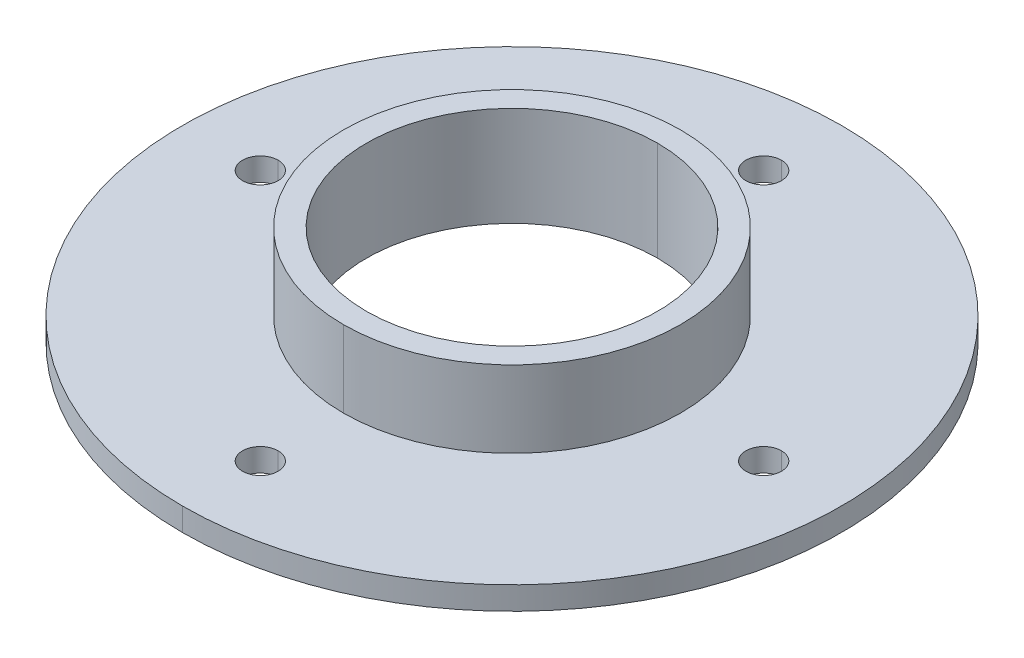
ISO-10303-21;
HEADER;
FILE_DESCRIPTION(('STEP AP214'),'2;1');
FILE_NAME('part.step','',(''),(''),'','','');
FILE_SCHEMA(('AUTOMOTIVE_DESIGN { 1 0 10303 214 1 1 1 1 }'));
ENDSEC;
DATA;
#1=APPLICATION_CONTEXT('core data for automotive mechanical design processes');
#2=APPLICATION_PROTOCOL_DEFINITION('international standard','automotive_design',2000,#1);
#3=PRODUCT_CONTEXT('',#1,'mechanical');
#4=PRODUCT('Part','Part','',(#3));
#5=PRODUCT_RELATED_PRODUCT_CATEGORY('part','',(#4));
#6=PRODUCT_DEFINITION_FORMATION('','',#4);
#7=PRODUCT_DEFINITION_CONTEXT('part definition',#1,'design');
#8=PRODUCT_DEFINITION('design','',#6,#7);
#9=PRODUCT_DEFINITION_SHAPE('','',#8);
#10=(LENGTH_UNIT() NAMED_UNIT(*) SI_UNIT(.MILLI.,.METRE.));
#11=(NAMED_UNIT(*) PLANE_ANGLE_UNIT() SI_UNIT($,.RADIAN.));
#12=(NAMED_UNIT(*) SI_UNIT($,.STERADIAN.) SOLID_ANGLE_UNIT());
#13=UNCERTAINTY_MEASURE_WITH_UNIT(LENGTH_MEASURE(1.E-05),#10,'distance_accuracy_value','');
#14=(GEOMETRIC_REPRESENTATION_CONTEXT(3) GLOBAL_UNCERTAINTY_ASSIGNED_CONTEXT((#13)) GLOBAL_UNIT_ASSIGNED_CONTEXT((#10,
#11,#12)) REPRESENTATION_CONTEXT('',''));
#15=CARTESIAN_POINT('',(0.,0.,0.));
#16=DIRECTION('',(0.,0.,1.));
#17=DIRECTION('',(1.,0.,0.));
#18=AXIS2_PLACEMENT_3D('',#15,#16,#17);
#19=CARTESIAN_POINT('',(0.,-17.,-32.8376892049422));
#20=DIRECTION('',(0.,1.,0.));
#21=DIRECTION('',(0.,0.,1.));
#22=AXIS2_PLACEMENT_3D('',#19,#20,#21);
#23=CYLINDRICAL_SURFACE('',#22,2.32018909355612);
#24=DIRECTION('',(0.,1.,0.));
#25=VECTOR('',#24,1.);
#26=CARTESIAN_POINT('',(0.,-17.,-35.1578782984983));
#27=LINE('',#26,#25);
#28=CARTESIAN_POINT('',(0.,0.,-35.1578782984983));
#29=VERTEX_POINT('',#28);
#30=CARTESIAN_POINT('',(0.,3.,-35.1578782984983));
#31=VERTEX_POINT('',#30);
#32=EDGE_CURVE('E256',#29,#31,#27,.T.);
#33=ORIENTED_EDGE('',*,*,#32,.F.);
#34=CARTESIAN_POINT('',(0.,0.,-32.8376892049422));
#35=DIRECTION('',(0.,1.,0.));
#36=DIRECTION('',(0.,0.,1.));
#37=AXIS2_PLACEMENT_3D('',#34,#35,#36);
#38=CIRCLE('',#37,2.32018909355612);
#39=CARTESIAN_POINT('',(0.,0.,-30.5175001113861));
#40=VERTEX_POINT('',#39);
#41=EDGE_CURVE('E82',#40,#29,#38,.T.);
#42=ORIENTED_EDGE('',*,*,#41,.F.);
#43=DIRECTION('',(0.,1.,0.));
#44=VECTOR('',#43,1.);
#45=CARTESIAN_POINT('',(0.,-17.,-30.5175001113861));
#46=LINE('',#45,#44);
#47=CARTESIAN_POINT('',(0.,3.,-30.5175001113861));
#48=VERTEX_POINT('',#47);
#49=EDGE_CURVE('E192',#40,#48,#46,.T.);
#50=ORIENTED_EDGE('',*,*,#49,.T.);
#51=CARTESIAN_POINT('',(0.,3.,-32.8376892049422));
#52=DIRECTION('',(0.,1.,0.));
#53=DIRECTION('',(0.,0.,1.));
#54=AXIS2_PLACEMENT_3D('',#51,#52,#53);
#55=CIRCLE('',#54,2.32018909355612);
#56=EDGE_CURVE('E69',#48,#31,#55,.T.);
#57=ORIENTED_EDGE('',*,*,#56,.T.);
#58=EDGE_LOOP('',(#33,#42,#50,#57));
#59=FACE_BOUND('',#58,.T.);
#60=ADVANCED_FACE('F15',(#59),#23,.F.);
#61=CARTESIAN_POINT('',(32.8376892049432,-17.,-9.27271075302349E-13));
#62=DIRECTION('',(0.,1.,0.));
#63=DIRECTION('',(0.,0.,1.));
#64=AXIS2_PLACEMENT_3D('',#61,#62,#63);
#65=CYLINDRICAL_SURFACE('',#64,2.32018909355684);
#66=DIRECTION('',(0.,1.,0.));
#67=VECTOR('',#66,1.);
#68=CARTESIAN_POINT('',(32.8376892049432,-17.,-2.32018909355777));
#69=LINE('',#68,#67);
#70=CARTESIAN_POINT('',(32.8376892049432,0.,-2.32018909355777));
#71=VERTEX_POINT('',#70);
#72=CARTESIAN_POINT('',(32.8376892049432,3.,-2.32018909355777));
#73=VERTEX_POINT('',#72);
#74=EDGE_CURVE('E174',#71,#73,#69,.T.);
#75=ORIENTED_EDGE('',*,*,#74,.F.);
#76=CARTESIAN_POINT('',(32.8376892049432,0.,-9.27271075302349E-13));
#77=DIRECTION('',(0.,1.,0.));
#78=DIRECTION('',(0.,0.,1.));
#79=AXIS2_PLACEMENT_3D('',#76,#77,#78);
#80=CIRCLE('',#79,2.32018909355684);
#81=CARTESIAN_POINT('',(32.8376892049432,0.,2.32018909355592));
#82=VERTEX_POINT('',#81);
#83=EDGE_CURVE('E168',#82,#71,#80,.T.);
#84=ORIENTED_EDGE('',*,*,#83,.F.);
#85=DIRECTION('',(0.,1.,0.));
#86=VECTOR('',#85,1.);
#87=CARTESIAN_POINT('',(32.8376892049432,-17.,2.32018909355592));
#88=LINE('',#87,#86);
#89=CARTESIAN_POINT('',(32.8376892049432,3.,2.32018909355592));
#90=VERTEX_POINT('',#89);
#91=EDGE_CURVE('E171',#82,#90,#88,.T.);
#92=ORIENTED_EDGE('',*,*,#91,.T.);
#93=CARTESIAN_POINT('',(32.8376892049432,3.,-9.27271075302349E-13));
#94=DIRECTION('',(0.,1.,0.));
#95=DIRECTION('',(0.,0.,1.));
#96=AXIS2_PLACEMENT_3D('',#93,#94,#95);
#97=CIRCLE('',#96,2.32018909355684);
#98=EDGE_CURVE('E293',#90,#73,#97,.T.);
#99=ORIENTED_EDGE('',*,*,#98,.T.);
#100=EDGE_LOOP('',(#75,#84,#92,#99));
#101=FACE_BOUND('',#100,.T.);
#102=ADVANCED_FACE('F170',(#101),#65,.F.);
#103=CARTESIAN_POINT('',(1.8545421506047E-12,-17.,32.8376892049422));
#104=DIRECTION('',(0.,1.,0.));
#105=DIRECTION('',(0.,0.,1.));
#106=AXIS2_PLACEMENT_3D('',#103,#104,#105);
#107=CYLINDRICAL_SURFACE('',#106,2.32018909355812);
#108=DIRECTION('',(0.,1.,0.));
#109=VECTOR('',#108,1.);
#110=CARTESIAN_POINT('',(1.85482629181938E-12,-17.,30.5175001113842));
#111=LINE('',#110,#109);
#112=CARTESIAN_POINT('',(1.85482629181938E-12,0.,30.5175001113842));
#113=VERTEX_POINT('',#112);
#114=CARTESIAN_POINT('',(1.85482629181938E-12,3.,30.5175001113842));
#115=VERTEX_POINT('',#114);
#116=EDGE_CURVE('E277',#113,#115,#111,.T.);
#117=ORIENTED_EDGE('',*,*,#116,.F.);
#118=CARTESIAN_POINT('',(1.8545421506047E-12,0.,32.8376892049422));
#119=DIRECTION('',(0.,1.,0.));
#120=DIRECTION('',(0.,0.,1.));
#121=AXIS2_PLACEMENT_3D('',#118,#119,#120);
#122=CIRCLE('',#121,2.32018909355812);
#123=CARTESIAN_POINT('',(1.8545421506047E-12,0.,35.1578782985003));
#124=VERTEX_POINT('',#123);
#125=EDGE_CURVE('E179',#124,#113,#122,.T.);
#126=ORIENTED_EDGE('',*,*,#125,.F.);
#127=DIRECTION('',(0.,1.,0.));
#128=VECTOR('',#127,1.);
#129=CARTESIAN_POINT('',(1.8545421506047E-12,-17.,35.1578782985003));
#130=LINE('',#129,#128);
#131=CARTESIAN_POINT('',(1.8545421506047E-12,3.,35.1578782985003));
#132=VERTEX_POINT('',#131);
#133=EDGE_CURVE('E211',#124,#132,#130,.T.);
#134=ORIENTED_EDGE('',*,*,#133,.T.);
#135=CARTESIAN_POINT('',(1.8545421506047E-12,3.,32.8376892049422));
#136=DIRECTION('',(0.,1.,0.));
#137=DIRECTION('',(0.,0.,1.));
#138=AXIS2_PLACEMENT_3D('',#135,#136,#137);
#139=CIRCLE('',#138,2.32018909355812);
#140=EDGE_CURVE('E115',#132,#115,#139,.T.);
#141=ORIENTED_EDGE('',*,*,#140,.T.);
#142=EDGE_LOOP('',(#117,#126,#134,#141));
#143=FACE_BOUND('',#142,.T.);
#144=ADVANCED_FACE('F548',(#143),#107,.F.);
#145=CARTESIAN_POINT('',(-32.8376892049413,-17.,9.31292532399972E-13));
#146=DIRECTION('',(0.,1.,0.));
#147=DIRECTION('',(0.,0.,1.));
#148=AXIS2_PLACEMENT_3D('',#145,#146,#147);
#149=CYLINDRICAL_SURFACE('',#148,2.32018909355761);
#150=DIRECTION('',(0.,1.,0.));
#151=VECTOR('',#150,1.);
#152=CARTESIAN_POINT('',(-32.8376892049413,-17.,-2.32018909355668));
#153=LINE('',#152,#151);
#154=CARTESIAN_POINT('',(-32.8376892049413,0.,-2.32018909355668));
#155=VERTEX_POINT('',#154);
#156=CARTESIAN_POINT('',(-32.8376892049413,3.,-2.32018909355668));
#157=VERTEX_POINT('',#156);
#158=EDGE_CURVE('E210',#155,#157,#153,.T.);
#159=ORIENTED_EDGE('',*,*,#158,.F.);
#160=CARTESIAN_POINT('',(-32.8376892049413,0.,9.31292532399972E-13));
#161=DIRECTION('',(0.,1.,0.));
#162=DIRECTION('',(0.,0.,1.));
#163=AXIS2_PLACEMENT_3D('',#160,#161,#162);
#164=CIRCLE('',#163,2.32018909355761);
#165=CARTESIAN_POINT('',(-32.8376892049413,0.,2.32018909355854));
#166=VERTEX_POINT('',#165);
#167=EDGE_CURVE('E237',#166,#155,#164,.T.);
#168=ORIENTED_EDGE('',*,*,#167,.F.);
#169=DIRECTION('',(0.,1.,0.));
#170=VECTOR('',#169,1.);
#171=CARTESIAN_POINT('',(-32.8376892049413,-17.,2.32018909355854));
#172=LINE('',#171,#170);
#173=CARTESIAN_POINT('',(-32.8376892049413,3.,2.32018909355854));
#174=VERTEX_POINT('',#173);
#175=EDGE_CURVE('E226',#166,#174,#172,.T.);
#176=ORIENTED_EDGE('',*,*,#175,.T.);
#177=CARTESIAN_POINT('',(-32.8376892049413,3.,9.31292532399972E-13));
#178=DIRECTION('',(0.,1.,0.));
#179=DIRECTION('',(0.,0.,1.));
#180=AXIS2_PLACEMENT_3D('',#177,#178,#179);
#181=CIRCLE('',#180,2.32018909355761);
#182=EDGE_CURVE('E307',#174,#157,#181,.T.);
#183=ORIENTED_EDGE('',*,*,#182,.T.);
#184=EDGE_LOOP('',(#159,#168,#176,#183));
#185=FACE_BOUND('',#184,.T.);
#186=ADVANCED_FACE('F538',(#185),#149,.F.);
#187=CARTESIAN_POINT('',(0.,13.,0.));
#188=DIRECTION('',(0.,-1.,0.));
#189=DIRECTION('',(0.,0.,-1.));
#190=AXIS2_PLACEMENT_3D('',#187,#188,#189);
#191=CYLINDRICAL_SURFACE('',#190,19.);
#192=DIRECTION('',(0.,-1.,0.));
#193=VECTOR('',#192,1.);
#194=CARTESIAN_POINT('',(0.,13.,19.));
#195=LINE('',#194,#193);
#196=CARTESIAN_POINT('',(0.,13.,19.));
#197=VERTEX_POINT('',#196);
#198=CARTESIAN_POINT('',(0.,0.,19.));
#199=VERTEX_POINT('',#198);
#200=EDGE_CURVE('E266',#197,#199,#195,.T.);
#201=ORIENTED_EDGE('',*,*,#200,.F.);
#202=CARTESIAN_POINT('',(0.,13.,0.));
#203=DIRECTION('',(0.,1.,0.));
#204=DIRECTION('',(0.,0.,1.));
#205=AXIS2_PLACEMENT_3D('',#202,#203,#204);
#206=CIRCLE('',#205,19.);
#207=CARTESIAN_POINT('',(0.,13.,-19.));
#208=VERTEX_POINT('',#207);
#209=EDGE_CURVE('E10',#197,#208,#206,.T.);
#210=ORIENTED_EDGE('',*,*,#209,.T.);
#211=DIRECTION('',(0.,-1.,0.));
#212=VECTOR('',#211,1.);
#213=CARTESIAN_POINT('',(0.,13.,-19.));
#214=LINE('',#213,#212);
#215=CARTESIAN_POINT('',(0.,0.,-19.));
#216=VERTEX_POINT('',#215);
#217=EDGE_CURVE('E204',#208,#216,#214,.T.);
#218=ORIENTED_EDGE('',*,*,#217,.T.);
#219=CARTESIAN_POINT('',(0.,0.,0.));
#220=DIRECTION('',(0.,1.,0.));
#221=DIRECTION('',(0.,0.,1.));
#222=AXIS2_PLACEMENT_3D('',#219,#220,#221);
#223=CIRCLE('',#222,19.);
#224=EDGE_CURVE('E240',#199,#216,#223,.T.);
#225=ORIENTED_EDGE('',*,*,#224,.F.);
#226=EDGE_LOOP('',(#201,#210,#218,#225));
#227=FACE_BOUND('',#226,.T.);
#228=ADVANCED_FACE('F527',(#227),#191,.F.);
#229=CARTESIAN_POINT('',(0.,13.,0.));
#230=DIRECTION('',(0.,-1.,0.));
#231=DIRECTION('',(0.,0.,-1.));
#232=AXIS2_PLACEMENT_3D('',#229,#230,#231);
#233=CYLINDRICAL_SURFACE('',#232,22.);
#234=DIRECTION('',(0.,-1.,0.));
#235=VECTOR('',#234,1.);
#236=CARTESIAN_POINT('',(0.,13.,22.));
#237=LINE('',#236,#235);
#238=CARTESIAN_POINT('',(0.,13.,22.));
#239=VERTEX_POINT('',#238);
#240=CARTESIAN_POINT('',(0.,3.,22.));
#241=VERTEX_POINT('',#240);
#242=EDGE_CURVE('E216',#239,#241,#237,.T.);
#243=ORIENTED_EDGE('',*,*,#242,.F.);
#244=CARTESIAN_POINT('',(0.,13.,0.));
#245=DIRECTION('',(0.,1.,0.));
#246=DIRECTION('',(0.,0.,1.));
#247=AXIS2_PLACEMENT_3D('',#244,#245,#246);
#248=CIRCLE('',#247,22.);
#249=CARTESIAN_POINT('',(0.,13.,-22.));
#250=VERTEX_POINT('',#249);
#251=EDGE_CURVE('E26',#250,#239,#248,.T.);
#252=ORIENTED_EDGE('',*,*,#251,.F.);
#253=DIRECTION('',(0.,-1.,0.));
#254=VECTOR('',#253,1.);
#255=CARTESIAN_POINT('',(0.,13.,-22.));
#256=LINE('',#255,#254);
#257=CARTESIAN_POINT('',(0.,3.,-22.));
#258=VERTEX_POINT('',#257);
#259=EDGE_CURVE('E221',#250,#258,#256,.T.);
#260=ORIENTED_EDGE('',*,*,#259,.T.);
#261=CARTESIAN_POINT('',(0.,3.,0.));
#262=DIRECTION('',(0.,1.,0.));
#263=DIRECTION('',(0.,0.,1.));
#264=AXIS2_PLACEMENT_3D('',#261,#262,#263);
#265=CIRCLE('',#264,22.);
#266=EDGE_CURVE('E271',#258,#241,#265,.T.);
#267=ORIENTED_EDGE('',*,*,#266,.T.);
#268=EDGE_LOOP('',(#243,#252,#260,#267));
#269=FACE_BOUND('',#268,.T.);
#270=ADVANCED_FACE('F515',(#269),#233,.T.);
#271=CARTESIAN_POINT('',(0.,13.,0.));
#272=DIRECTION('',(0.,1.,0.));
#273=DIRECTION('',(1.,0.,0.));
#274=AXIS2_PLACEMENT_3D('',#271,#272,#273);
#275=PLANE('',#274);
#276=CARTESIAN_POINT('',(0.,13.,0.));
#277=DIRECTION('',(0.,1.,0.));
#278=DIRECTION('',(0.,0.,1.));
#279=AXIS2_PLACEMENT_3D('',#276,#277,#278);
#280=CIRCLE('',#279,19.);
#281=EDGE_CURVE('E297',#208,#197,#280,.T.);
#282=ORIENTED_EDGE('',*,*,#281,.F.);
#283=ORIENTED_EDGE('',*,*,#209,.F.);
#284=EDGE_LOOP('',(#282,#283));
#285=FACE_BOUND('',#284,.T.);
#286=ORIENTED_EDGE('',*,*,#251,.T.);
#287=CARTESIAN_POINT('',(0.,13.,0.));
#288=DIRECTION('',(0.,1.,0.));
#289=DIRECTION('',(0.,0.,1.));
#290=AXIS2_PLACEMENT_3D('',#287,#288,#289);
#291=CIRCLE('',#290,22.);
#292=EDGE_CURVE('E212',#239,#250,#291,.T.);
#293=ORIENTED_EDGE('',*,*,#292,.T.);
#294=EDGE_LOOP('',(#286,#293));
#295=FACE_BOUND('',#294,.T.);
#296=ADVANCED_FACE('F504',(#285,#295),#275,.T.);
#297=CARTESIAN_POINT('',(0.,0.,0.));
#298=DIRECTION('',(0.,1.,0.));
#299=DIRECTION('',(1.,0.,0.));
#300=AXIS2_PLACEMENT_3D('',#297,#298,#299);
#301=PLANE('',#300);
#302=CARTESIAN_POINT('',(0.,0.,0.));
#303=DIRECTION('',(0.,1.,0.));
#304=DIRECTION('',(0.,0.,1.));
#305=AXIS2_PLACEMENT_3D('',#302,#303,#304);
#306=CIRCLE('',#305,19.);
#307=EDGE_CURVE('E262',#216,#199,#306,.T.);
#308=ORIENTED_EDGE('',*,*,#307,.T.);
#309=ORIENTED_EDGE('',*,*,#224,.T.);
#310=EDGE_LOOP('',(#308,#309));
#311=FACE_BOUND('',#310,.T.);
#312=ORIENTED_EDGE('',*,*,#167,.T.);
#313=CARTESIAN_POINT('',(-32.8376892049413,0.,9.31292532399972E-13));
#314=DIRECTION('',(0.,1.,0.));
#315=DIRECTION('',(0.,0.,1.));
#316=AXIS2_PLACEMENT_3D('',#313,#314,#315);
#317=CIRCLE('',#316,2.32018909355761);
#318=EDGE_CURVE('E206',#155,#166,#317,.T.);
#319=ORIENTED_EDGE('',*,*,#318,.T.);
#320=EDGE_LOOP('',(#312,#319));
#321=FACE_BOUND('',#320,.T.);
#322=ORIENTED_EDGE('',*,*,#125,.T.);
#323=CARTESIAN_POINT('',(1.8545421506047E-12,0.,32.8376892049422));
#324=DIRECTION('',(0.,1.,0.));
#325=DIRECTION('',(0.,0.,1.));
#326=AXIS2_PLACEMENT_3D('',#323,#324,#325);
#327=CIRCLE('',#326,2.32018909355812);
#328=EDGE_CURVE('E187',#113,#124,#327,.T.);
#329=ORIENTED_EDGE('',*,*,#328,.T.);
#330=EDGE_LOOP('',(#322,#329));
#331=FACE_BOUND('',#330,.T.);
#332=ORIENTED_EDGE('',*,*,#83,.T.);
#333=CARTESIAN_POINT('',(32.8376892049432,0.,-9.27271075302349E-13));
#334=DIRECTION('',(0.,1.,0.));
#335=DIRECTION('',(0.,0.,1.));
#336=AXIS2_PLACEMENT_3D('',#333,#334,#335);
#337=CIRCLE('',#336,2.32018909355684);
#338=EDGE_CURVE('E183',#71,#82,#337,.T.);
#339=ORIENTED_EDGE('',*,*,#338,.T.);
#340=EDGE_LOOP('',(#332,#339));
#341=FACE_BOUND('',#340,.T.);
#342=ORIENTED_EDGE('',*,*,#41,.T.);
#343=CARTESIAN_POINT('',(0.,0.,-32.8376892049422));
#344=DIRECTION('',(0.,1.,0.));
#345=DIRECTION('',(0.,0.,1.));
#346=AXIS2_PLACEMENT_3D('',#343,#344,#345);
#347=CIRCLE('',#346,2.32018909355612);
#348=EDGE_CURVE('E252',#29,#40,#347,.T.);
#349=ORIENTED_EDGE('',*,*,#348,.T.);
#350=EDGE_LOOP('',(#342,#349));
#351=FACE_BOUND('',#350,.T.);
#352=CARTESIAN_POINT('',(0.,0.,0.));
#353=DIRECTION('',(0.,1.,0.));
#354=DIRECTION('',(0.,0.,1.));
#355=AXIS2_PLACEMENT_3D('',#352,#353,#354);
#356=CIRCLE('',#355,43.);
#357=CARTESIAN_POINT('',(0.,0.,-43.));
#358=VERTEX_POINT('',#357);
#359=CARTESIAN_POINT('',(0.,0.,43.));
#360=VERTEX_POINT('',#359);
#361=EDGE_CURVE('E40',#358,#360,#356,.T.);
#362=ORIENTED_EDGE('',*,*,#361,.F.);
#363=CARTESIAN_POINT('',(0.,0.,0.));
#364=DIRECTION('',(0.,1.,0.));
#365=DIRECTION('',(0.,0.,1.));
#366=AXIS2_PLACEMENT_3D('',#363,#364,#365);
#367=CIRCLE('',#366,43.);
#368=EDGE_CURVE('E230',#360,#358,#367,.T.);
#369=ORIENTED_EDGE('',*,*,#368,.F.);
#370=EDGE_LOOP('',(#362,#369));
#371=FACE_BOUND('',#370,.T.);
#372=ADVANCED_FACE('F189',(#311,#321,#331,#341,#351,#371),#301,.F.);
#373=CARTESIAN_POINT('',(0.,3.,0.));
#374=DIRECTION('',(0.,1.,0.));
#375=DIRECTION('',(1.,0.,0.));
#376=AXIS2_PLACEMENT_3D('',#373,#374,#375);
#377=PLANE('',#376);
#378=ORIENTED_EDGE('',*,*,#266,.F.);
#379=CARTESIAN_POINT('',(0.,3.,0.));
#380=DIRECTION('',(0.,1.,0.));
#381=DIRECTION('',(0.,0.,1.));
#382=AXIS2_PLACEMENT_3D('',#379,#380,#381);
#383=CIRCLE('',#382,22.);
#384=EDGE_CURVE('E217',#241,#258,#383,.T.);
#385=ORIENTED_EDGE('',*,*,#384,.F.);
#386=EDGE_LOOP('',(#378,#385));
#387=FACE_BOUND('',#386,.T.);
#388=ORIENTED_EDGE('',*,*,#182,.F.);
#389=CARTESIAN_POINT('',(-32.8376892049413,3.,9.31292532399972E-13));
#390=DIRECTION('',(0.,1.,0.));
#391=DIRECTION('',(0.,0.,1.));
#392=AXIS2_PLACEMENT_3D('',#389,#390,#391);
#393=CIRCLE('',#392,2.32018909355761);
#394=EDGE_CURVE('E222',#157,#174,#393,.T.);
#395=ORIENTED_EDGE('',*,*,#394,.F.);
#396=EDGE_LOOP('',(#388,#395));
#397=FACE_BOUND('',#396,.T.);
#398=ORIENTED_EDGE('',*,*,#140,.F.);
#399=CARTESIAN_POINT('',(1.8545421506047E-12,3.,32.8376892049422));
#400=DIRECTION('',(0.,1.,0.));
#401=DIRECTION('',(0.,0.,1.));
#402=AXIS2_PLACEMENT_3D('',#399,#400,#401);
#403=CIRCLE('',#402,2.32018909355812);
#404=EDGE_CURVE('E274',#115,#132,#403,.T.);
#405=ORIENTED_EDGE('',*,*,#404,.F.);
#406=EDGE_LOOP('',(#398,#405));
#407=FACE_BOUND('',#406,.T.);
#408=ORIENTED_EDGE('',*,*,#98,.F.);
#409=CARTESIAN_POINT('',(32.8376892049432,3.,-9.27271075302349E-13));
#410=DIRECTION('',(0.,1.,0.));
#411=DIRECTION('',(0.,0.,1.));
#412=AXIS2_PLACEMENT_3D('',#409,#410,#411);
#413=CIRCLE('',#412,2.32018909355684);
#414=EDGE_CURVE('E185',#73,#90,#413,.T.);
#415=ORIENTED_EDGE('',*,*,#414,.F.);
#416=EDGE_LOOP('',(#408,#415));
#417=FACE_BOUND('',#416,.T.);
#418=ORIENTED_EDGE('',*,*,#56,.F.);
#419=CARTESIAN_POINT('',(0.,3.,-32.8376892049422));
#420=DIRECTION('',(0.,1.,0.));
#421=DIRECTION('',(0.,0.,1.));
#422=AXIS2_PLACEMENT_3D('',#419,#420,#421);
#423=CIRCLE('',#422,2.32018909355612);
#424=EDGE_CURVE('E200',#31,#48,#423,.T.);
#425=ORIENTED_EDGE('',*,*,#424,.F.);
#426=EDGE_LOOP('',(#418,#425));
#427=FACE_BOUND('',#426,.T.);
#428=CARTESIAN_POINT('',(0.,3.,0.));
#429=DIRECTION('',(0.,1.,0.));
#430=DIRECTION('',(0.,0.,1.));
#431=AXIS2_PLACEMENT_3D('',#428,#429,#430);
#432=CIRCLE('',#431,43.);
#433=CARTESIAN_POINT('',(0.,3.,-43.));
#434=VERTEX_POINT('',#433);
#435=CARTESIAN_POINT('',(0.,3.,43.));
#436=VERTEX_POINT('',#435);
#437=EDGE_CURVE('E229',#434,#436,#432,.T.);
#438=ORIENTED_EDGE('',*,*,#437,.T.);
#439=CARTESIAN_POINT('',(0.,3.,0.));
#440=DIRECTION('',(0.,1.,0.));
#441=DIRECTION('',(0.,0.,1.));
#442=AXIS2_PLACEMENT_3D('',#439,#440,#441);
#443=CIRCLE('',#442,43.);
#444=EDGE_CURVE('E250',#436,#434,#443,.T.);
#445=ORIENTED_EDGE('',*,*,#444,.T.);
#446=EDGE_LOOP('',(#438,#445));
#447=FACE_BOUND('',#446,.T.);
#448=ADVANCED_FACE('F483',(#387,#397,#407,#417,#427,#447),#377,.T.);
#449=CARTESIAN_POINT('',(0.,3.,0.));
#450=DIRECTION('',(0.,-1.,0.));
#451=DIRECTION('',(0.,0.,-1.));
#452=AXIS2_PLACEMENT_3D('',#449,#450,#451);
#453=CYLINDRICAL_SURFACE('',#452,43.);
#454=DIRECTION('',(0.,-1.,0.));
#455=VECTOR('',#454,1.);
#456=CARTESIAN_POINT('',(0.,3.,43.));
#457=LINE('',#456,#455);
#458=EDGE_CURVE('E19',#436,#360,#457,.T.);
#459=ORIENTED_EDGE('',*,*,#458,.F.);
#460=ORIENTED_EDGE('',*,*,#437,.F.);
#461=DIRECTION('',(0.,-1.,0.));
#462=VECTOR('',#461,1.);
#463=CARTESIAN_POINT('',(0.,3.,-43.));
#464=LINE('',#463,#462);
#465=EDGE_CURVE('E227',#434,#358,#464,.T.);
#466=ORIENTED_EDGE('',*,*,#465,.T.);
#467=ORIENTED_EDGE('',*,*,#361,.T.);
#468=EDGE_LOOP('',(#459,#460,#466,#467));
#469=FACE_BOUND('',#468,.T.);
#470=ADVANCED_FACE('F17',(#469),#453,.T.);
#471=CARTESIAN_POINT('',(0.,3.,0.));
#472=DIRECTION('',(0.,-1.,0.));
#473=DIRECTION('',(0.,0.,-1.));
#474=AXIS2_PLACEMENT_3D('',#471,#472,#473);
#475=CYLINDRICAL_SURFACE('',#474,43.);
#476=ORIENTED_EDGE('',*,*,#444,.F.);
#477=ORIENTED_EDGE('',*,*,#458,.T.);
#478=ORIENTED_EDGE('',*,*,#368,.T.);
#479=ORIENTED_EDGE('',*,*,#465,.F.);
#480=EDGE_LOOP('',(#476,#477,#478,#479));
#481=FACE_BOUND('',#480,.T.);
#482=ADVANCED_FACE('F461',(#481),#475,.T.);
#483=CARTESIAN_POINT('',(0.,13.,0.));
#484=DIRECTION('',(0.,-1.,0.));
#485=DIRECTION('',(0.,0.,-1.));
#486=AXIS2_PLACEMENT_3D('',#483,#484,#485);
#487=CYLINDRICAL_SURFACE('',#486,22.);
#488=ORIENTED_EDGE('',*,*,#292,.F.);
#489=ORIENTED_EDGE('',*,*,#242,.T.);
#490=ORIENTED_EDGE('',*,*,#384,.T.);
#491=ORIENTED_EDGE('',*,*,#259,.F.);
#492=EDGE_LOOP('',(#488,#489,#490,#491));
#493=FACE_BOUND('',#492,.T.);
#494=ADVANCED_FACE('F449',(#493),#487,.T.);
#495=CARTESIAN_POINT('',(0.,13.,0.));
#496=DIRECTION('',(0.,-1.,0.));
#497=DIRECTION('',(0.,0.,-1.));
#498=AXIS2_PLACEMENT_3D('',#495,#496,#497);
#499=CYLINDRICAL_SURFACE('',#498,19.);
#500=ORIENTED_EDGE('',*,*,#281,.T.);
#501=ORIENTED_EDGE('',*,*,#200,.T.);
#502=ORIENTED_EDGE('',*,*,#307,.F.);
#503=ORIENTED_EDGE('',*,*,#217,.F.);
#504=EDGE_LOOP('',(#500,#501,#502,#503));
#505=FACE_BOUND('',#504,.T.);
#506=ADVANCED_FACE('F436',(#505),#499,.F.);
#507=CARTESIAN_POINT('',(-32.8376892049413,-17.,9.31292532399972E-13));
#508=DIRECTION('',(0.,1.,0.));
#509=DIRECTION('',(0.,0.,1.));
#510=AXIS2_PLACEMENT_3D('',#507,#508,#509);
#511=CYLINDRICAL_SURFACE('',#510,2.32018909355761);
#512=ORIENTED_EDGE('',*,*,#318,.F.);
#513=ORIENTED_EDGE('',*,*,#158,.T.);
#514=ORIENTED_EDGE('',*,*,#394,.T.);
#515=ORIENTED_EDGE('',*,*,#175,.F.);
#516=EDGE_LOOP('',(#512,#513,#514,#515));
#517=FACE_BOUND('',#516,.T.);
#518=ADVANCED_FACE('F424',(#517),#511,.F.);
#519=CARTESIAN_POINT('',(1.8545421506047E-12,-17.,32.8376892049422));
#520=DIRECTION('',(0.,1.,0.));
#521=DIRECTION('',(0.,0.,1.));
#522=AXIS2_PLACEMENT_3D('',#519,#520,#521);
#523=CYLINDRICAL_SURFACE('',#522,2.32018909355812);
#524=ORIENTED_EDGE('',*,*,#328,.F.);
#525=ORIENTED_EDGE('',*,*,#116,.T.);
#526=ORIENTED_EDGE('',*,*,#404,.T.);
#527=ORIENTED_EDGE('',*,*,#133,.F.);
#528=EDGE_LOOP('',(#524,#525,#526,#527));
#529=FACE_BOUND('',#528,.T.);
#530=ADVANCED_FACE('F411',(#529),#523,.F.);
#531=CARTESIAN_POINT('',(32.8376892049432,-17.,-9.27271075302349E-13));
#532=DIRECTION('',(0.,1.,0.));
#533=DIRECTION('',(0.,0.,1.));
#534=AXIS2_PLACEMENT_3D('',#531,#532,#533);
#535=CYLINDRICAL_SURFACE('',#534,2.32018909355684);
#536=ORIENTED_EDGE('',*,*,#338,.F.);
#537=ORIENTED_EDGE('',*,*,#74,.T.);
#538=ORIENTED_EDGE('',*,*,#414,.T.);
#539=ORIENTED_EDGE('',*,*,#91,.F.);
#540=EDGE_LOOP('',(#536,#537,#538,#539));
#541=FACE_BOUND('',#540,.T.);
#542=ADVANCED_FACE('F182',(#541),#535,.F.);
#543=CARTESIAN_POINT('',(0.,-17.,-32.8376892049422));
#544=DIRECTION('',(0.,1.,0.));
#545=DIRECTION('',(0.,0.,1.));
#546=AXIS2_PLACEMENT_3D('',#543,#544,#545);
#547=CYLINDRICAL_SURFACE('',#546,2.32018909355612);
#548=ORIENTED_EDGE('',*,*,#348,.F.);
#549=ORIENTED_EDGE('',*,*,#32,.T.);
#550=ORIENTED_EDGE('',*,*,#424,.T.);
#551=ORIENTED_EDGE('',*,*,#49,.F.);
#552=EDGE_LOOP('',(#548,#549,#550,#551));
#553=FACE_BOUND('',#552,.T.);
#554=ADVANCED_FACE('F391',(#553),#547,.F.);
#555=CLOSED_SHELL('',(#60,#102,#144,#186,#228,#270,#296,#372,#448,#470,#482,#494,#506,#518,#530,
#542,#554));
#556=MANIFOLD_SOLID_BREP('B1',#555);
#557=ADVANCED_BREP_SHAPE_REPRESENTATION('',(#18,#556),#14);
#558=SHAPE_DEFINITION_REPRESENTATION(#9,#557);
ENDSEC;
END-ISO-10303-21;
